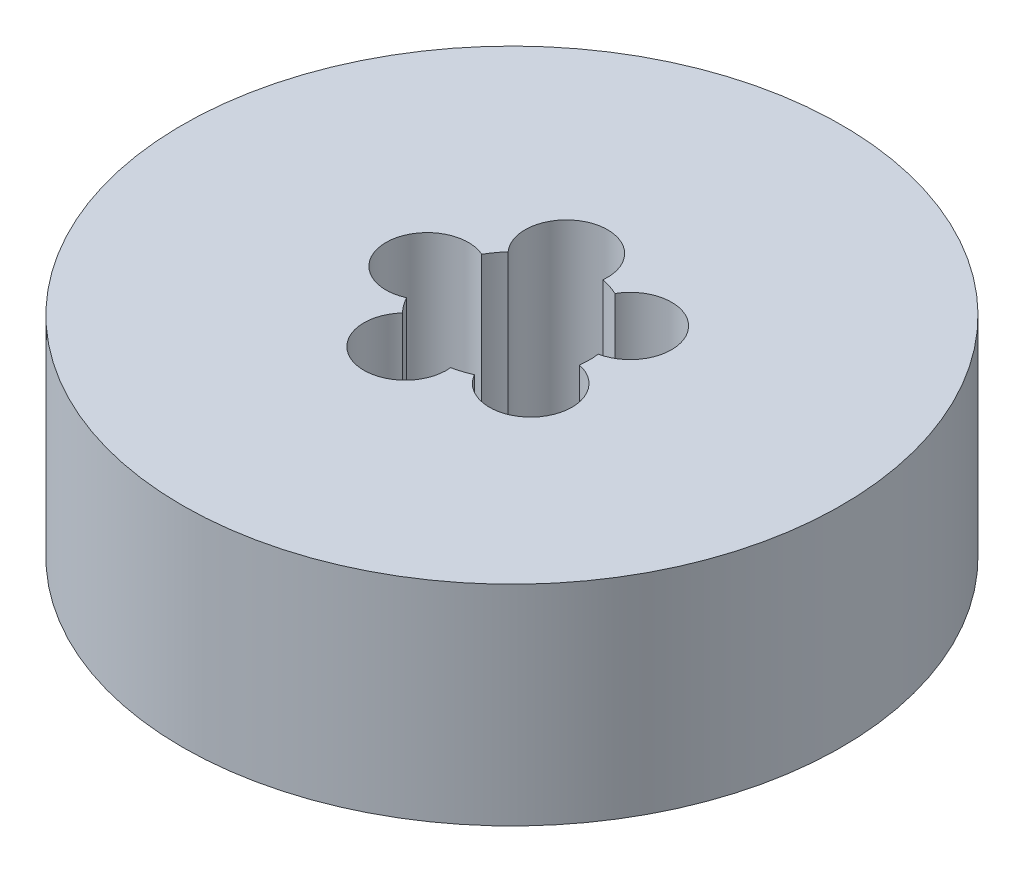
ISO-10303-21;
HEADER;
FILE_DESCRIPTION(('STEP AP214'),'2;1');
FILE_NAME('part.step','',(''),(''),'','','');
FILE_SCHEMA(('AUTOMOTIVE_DESIGN { 1 0 10303 214 1 1 1 1 }'));
ENDSEC;
DATA;
#1=APPLICATION_CONTEXT('core data for automotive mechanical design processes');
#2=APPLICATION_PROTOCOL_DEFINITION('international standard','automotive_design',2000,#1);
#3=PRODUCT_CONTEXT('',#1,'mechanical');
#4=PRODUCT('Part','Part','',(#3));
#5=PRODUCT_RELATED_PRODUCT_CATEGORY('part','',(#4));
#6=PRODUCT_DEFINITION_FORMATION('','',#4);
#7=PRODUCT_DEFINITION_CONTEXT('part definition',#1,'design');
#8=PRODUCT_DEFINITION('design','',#6,#7);
#9=PRODUCT_DEFINITION_SHAPE('','',#8);
#10=(LENGTH_UNIT() NAMED_UNIT(*) SI_UNIT(.MILLI.,.METRE.));
#11=(NAMED_UNIT(*) PLANE_ANGLE_UNIT() SI_UNIT($,.RADIAN.));
#12=(NAMED_UNIT(*) SI_UNIT($,.STERADIAN.) SOLID_ANGLE_UNIT());
#13=UNCERTAINTY_MEASURE_WITH_UNIT(LENGTH_MEASURE(1.E-05),#10,'distance_accuracy_value','');
#14=(GEOMETRIC_REPRESENTATION_CONTEXT(3) GLOBAL_UNCERTAINTY_ASSIGNED_CONTEXT((#13)) GLOBAL_UNIT_ASSIGNED_CONTEXT((#10,
#11,#12)) REPRESENTATION_CONTEXT('',''));
#15=CARTESIAN_POINT('',(0.,0.,0.));
#16=DIRECTION('',(0.,0.,1.));
#17=DIRECTION('',(1.,0.,0.));
#18=AXIS2_PLACEMENT_3D('',#15,#16,#17);
#19=CARTESIAN_POINT('',(0.,27.,0.));
#20=DIRECTION('',(0.,-1.,0.));
#21=DIRECTION('',(0.,0.,-1.));
#22=AXIS2_PLACEMENT_3D('',#19,#20,#21);
#23=CYLINDRICAL_SURFACE('',#22,42.5);
#24=CARTESIAN_POINT('',(0.,27.,0.));
#25=DIRECTION('',(0.,1.,0.));
#26=DIRECTION('',(0.,0.,1.));
#27=AXIS2_PLACEMENT_3D('',#24,#25,#26);
#28=CIRCLE('',#27,42.5);
#29=CARTESIAN_POINT('',(0.,27.,42.5));
#30=VERTEX_POINT('',#29);
#31=EDGE_CURVE('E157',#30,#30,#28,.T.);
#32=ORIENTED_EDGE('',*,*,#31,.F.);
#33=EDGE_LOOP('',(#32));
#34=FACE_BOUND('',#33,.T.);
#35=CARTESIAN_POINT('',(0.,0.,0.));
#36=DIRECTION('',(0.,1.,0.));
#37=DIRECTION('',(0.,0.,1.));
#38=AXIS2_PLACEMENT_3D('',#35,#36,#37);
#39=CIRCLE('',#38,42.5);
#40=CARTESIAN_POINT('',(0.,0.,42.5));
#41=VERTEX_POINT('',#40);
#42=EDGE_CURVE('E150',#41,#41,#39,.T.);
#43=ORIENTED_EDGE('',*,*,#42,.T.);
#44=EDGE_LOOP('',(#43));
#45=FACE_BOUND('',#44,.T.);
#46=ADVANCED_FACE('F39',(#34,#45),#23,.T.);
#47=CARTESIAN_POINT('',(0.,27.,0.));
#48=DIRECTION('',(0.,1.,0.));
#49=DIRECTION('',(0.,0.,1.));
#50=AXIS2_PLACEMENT_3D('',#47,#48,#49);
#51=PLANE('',#50);
#52=CARTESIAN_POINT('',(-3.37625005022032,27.,-10.3910291969498));
#53=DIRECTION('',(0.,1.,0.));
#54=DIRECTION('',(-0.95105651629515,0.,0.309016994374958));
#55=AXIS2_PLACEMENT_3D('',#52,#53,#54);
#56=CIRCLE('',#55,5.31953198471748);
#57=CARTESIAN_POINT('',(1.91205654561294,27.,-9.81549997536441));
#58=VERTEX_POINT('',#57);
#59=CARTESIAN_POINT('',(-7.31629236900321,27.,-6.81702764929594));
#60=VERTEX_POINT('',#59);
#61=EDGE_CURVE('E194',#58,#60,#56,.T.);
#62=ORIENTED_EDGE('',*,*,#61,.F.);
#63=CARTESIAN_POINT('',(0.,27.,0.));
#64=DIRECTION('',(0.,1.,0.));
#65=DIRECTION('',(0.,0.,1.));
#66=AXIS2_PLACEMENT_3D('',#63,#64,#65);
#67=CIRCLE('',#66,10.);
#68=CARTESIAN_POINT('',(4.22251988978942,27.,-9.06478492741735));
#69=VERTEX_POINT('',#68);
#70=EDGE_CURVE('E147',#69,#58,#67,.T.);
#71=ORIENTED_EDGE('',*,*,#70,.F.);
#72=CARTESIAN_POINT('',(8.83913738599498,27.,-6.42200922180761));
#73=DIRECTION('',(0.,1.,0.));
#74=DIRECTION('',(-0.58778525229248,0.,-0.809016994374942));
#75=AXIS2_PLACEMENT_3D('',#72,#73,#74);
#76=CIRCLE('',#75,5.31953198471748);
#77=CARTESIAN_POINT('',(9.9259531790655,27.,-1.21468246344447));
#78=VERTEX_POINT('',#77);
#79=EDGE_CURVE('E254',#78,#69,#76,.T.);
#80=ORIENTED_EDGE('',*,*,#79,.F.);
#81=CARTESIAN_POINT('',(9.92595317906552,27.,1.21468246344432));
#82=VERTEX_POINT('',#81);
#83=EDGE_CURVE('E144',#82,#78,#67,.T.);
#84=ORIENTED_EDGE('',*,*,#83,.F.);
#85=CARTESIAN_POINT('',(8.83913738599507,27.,6.42200922180748));
#86=DIRECTION('',(0.,1.,0.));
#87=DIRECTION('',(0.587785252292469,0.,-0.809016994374951));
#88=AXIS2_PLACEMENT_3D('',#85,#86,#87);
#89=CIRCLE('',#88,5.31953198471748);
#90=CARTESIAN_POINT('',(4.22251988978956,27.,9.06478492741729));
#91=VERTEX_POINT('',#90);
#92=EDGE_CURVE('E141',#91,#82,#89,.T.);
#93=ORIENTED_EDGE('',*,*,#92,.F.);
#94=CARTESIAN_POINT('',(1.91205654561308,27.,9.81549997536438));
#95=VERTEX_POINT('',#94);
#96=EDGE_CURVE('E134',#95,#91,#67,.T.);
#97=ORIENTED_EDGE('',*,*,#96,.F.);
#98=CARTESIAN_POINT('',(-3.37625005022018,27.,10.3910291969499));
#99=DIRECTION('',(0.,1.,0.));
#100=DIRECTION('',(0.951056516295155,0.,0.309016994374945));
#101=AXIS2_PLACEMENT_3D('',#98,#99,#100);
#102=CIRCLE('',#101,5.31953198471748);
#103=CARTESIAN_POINT('',(-7.31629236900312,27.,6.81702764929605));
#104=VERTEX_POINT('',#103);
#105=EDGE_CURVE('E111',#104,#95,#102,.T.);
#106=ORIENTED_EDGE('',*,*,#105,.F.);
#107=CARTESIAN_POINT('',(-8.74423724546493,27.,4.85163013790457));
#108=VERTEX_POINT('',#107);
#109=EDGE_CURVE('E145',#108,#104,#67,.T.);
#110=ORIENTED_EDGE('',*,*,#109,.F.);
#111=CARTESIAN_POINT('',(-10.9257746715497,27.,0.));
#112=DIRECTION('',(0.,1.,0.));
#113=DIRECTION('',(0.,0.,1.));
#114=AXIS2_PLACEMENT_3D('',#111,#112,#113);
#115=CIRCLE('',#114,5.31953198471748);
#116=CARTESIAN_POINT('',(-8.74423724546493,27.,-4.85163013790457));
#117=VERTEX_POINT('',#116);
#118=EDGE_CURVE('E153',#117,#108,#115,.T.);
#119=ORIENTED_EDGE('',*,*,#118,.F.);
#120=EDGE_CURVE('E146',#60,#117,#67,.T.);
#121=ORIENTED_EDGE('',*,*,#120,.F.);
#122=EDGE_LOOP('',(#62,#71,#80,#84,#93,#97,#106,#110,#119,#121));
#123=FACE_BOUND('',#122,.T.);
#124=ORIENTED_EDGE('',*,*,#31,.T.);
#125=EDGE_LOOP('',(#124));
#126=FACE_BOUND('',#125,.T.);
#127=ADVANCED_FACE('F139',(#123,#126),#51,.T.);
#128=CARTESIAN_POINT('',(0.,0.,0.));
#129=DIRECTION('',(0.,1.,0.));
#130=DIRECTION('',(0.,0.,1.));
#131=AXIS2_PLACEMENT_3D('',#128,#129,#130);
#132=PLANE('',#131);
#133=CARTESIAN_POINT('',(0.,0.,0.));
#134=DIRECTION('',(0.,1.,0.));
#135=DIRECTION('',(0.,0.,1.));
#136=AXIS2_PLACEMENT_3D('',#133,#134,#135);
#137=CIRCLE('',#136,10.);
#138=CARTESIAN_POINT('',(0.,0.,10.));
#139=VERTEX_POINT('',#138);
#140=EDGE_CURVE('E154',#139,#139,#137,.T.);
#141=ORIENTED_EDGE('',*,*,#140,.T.);
#142=EDGE_LOOP('',(#141));
#143=FACE_BOUND('',#142,.T.);
#144=ORIENTED_EDGE('',*,*,#42,.F.);
#145=EDGE_LOOP('',(#144));
#146=FACE_BOUND('',#145,.T.);
#147=ADVANCED_FACE('F213',(#143,#146),#132,.F.);
#148=CARTESIAN_POINT('',(0.,27.,0.));
#149=DIRECTION('',(0.,-1.,0.));
#150=DIRECTION('',(0.,0.,-1.));
#151=AXIS2_PLACEMENT_3D('',#148,#149,#150);
#152=CYLINDRICAL_SURFACE('',#151,10.);
#153=DIRECTION('',(0.,1.,0.));
#154=VECTOR('',#153,1.);
#155=CARTESIAN_POINT('',(1.91205654561294,14.9213630930182,-9.81549997536441));
#156=LINE('',#155,#154);
#157=CARTESIAN_POINT('',(1.91205654561294,2.84272618603638,-9.81549997536441));
#158=VERTEX_POINT('',#157);
#159=EDGE_CURVE('E11',#158,#58,#156,.T.);
#160=ORIENTED_EDGE('',*,*,#159,.F.);
#161=CARTESIAN_POINT('',(0.,2.84272618603638,0.));
#162=DIRECTION('',(0.,1.,0.));
#163=DIRECTION('',(0.,0.,1.));
#164=AXIS2_PLACEMENT_3D('',#161,#162,#163);
#165=CIRCLE('',#164,10.);
#166=CARTESIAN_POINT('',(-7.31629236900321,2.84272618603638,-6.81702764929594));
#167=VERTEX_POINT('',#166);
#168=EDGE_CURVE('E189',#158,#167,#165,.T.);
#169=ORIENTED_EDGE('',*,*,#168,.T.);
#170=DIRECTION('',(0.,1.,0.));
#171=VECTOR('',#170,1.);
#172=CARTESIAN_POINT('',(-7.31629236900321,14.9213630930182,-6.81702764929594));
#173=LINE('',#172,#171);
#174=EDGE_CURVE('E46',#60,#167,#173,.F.);
#175=ORIENTED_EDGE('',*,*,#174,.F.);
#176=ORIENTED_EDGE('',*,*,#120,.T.);
#177=DIRECTION('',(0.,1.,0.));
#178=VECTOR('',#177,1.);
#179=CARTESIAN_POINT('',(-8.74423724546493,14.9213630930182,-4.85163013790457));
#180=LINE('',#179,#178);
#181=CARTESIAN_POINT('',(-8.74423724546493,2.84272618603638,-4.85163013790457));
#182=VERTEX_POINT('',#181);
#183=EDGE_CURVE('E168',#182,#117,#180,.T.);
#184=ORIENTED_EDGE('',*,*,#183,.F.);
#185=CARTESIAN_POINT('',(0.,2.84272618603638,0.));
#186=DIRECTION('',(0.,1.,0.));
#187=DIRECTION('',(0.,0.,1.));
#188=AXIS2_PLACEMENT_3D('',#185,#186,#187);
#189=CIRCLE('',#188,10.);
#190=CARTESIAN_POINT('',(-8.74423724546493,2.84272618603638,4.85163013790457));
#191=VERTEX_POINT('',#190);
#192=EDGE_CURVE('E165',#182,#191,#189,.T.);
#193=ORIENTED_EDGE('',*,*,#192,.T.);
#194=DIRECTION('',(0.,1.,0.));
#195=VECTOR('',#194,1.);
#196=CARTESIAN_POINT('',(-8.74423724546493,14.9213630930182,4.85163013790457));
#197=LINE('',#196,#195);
#198=EDGE_CURVE('E170',#108,#191,#197,.F.);
#199=ORIENTED_EDGE('',*,*,#198,.F.);
#200=ORIENTED_EDGE('',*,*,#109,.T.);
#201=DIRECTION('',(0.,1.,0.));
#202=VECTOR('',#201,1.);
#203=CARTESIAN_POINT('',(-7.31629236900311,14.9213630930182,6.81702764929605));
#204=LINE('',#203,#202);
#205=CARTESIAN_POINT('',(-7.31629236900312,2.84272618603638,6.81702764929605));
#206=VERTEX_POINT('',#205);
#207=EDGE_CURVE('E121',#206,#104,#204,.T.);
#208=ORIENTED_EDGE('',*,*,#207,.F.);
#209=CARTESIAN_POINT('',(0.,2.84272618603638,0.));
#210=DIRECTION('',(0.,1.,0.));
#211=DIRECTION('',(0.,0.,1.));
#212=AXIS2_PLACEMENT_3D('',#209,#210,#211);
#213=CIRCLE('',#212,10.);
#214=CARTESIAN_POINT('',(1.91205654561308,2.84272618603638,9.81549997536438));
#215=VERTEX_POINT('',#214);
#216=EDGE_CURVE('E136',#206,#215,#213,.T.);
#217=ORIENTED_EDGE('',*,*,#216,.T.);
#218=DIRECTION('',(0.,1.,0.));
#219=VECTOR('',#218,1.);
#220=CARTESIAN_POINT('',(1.91205654561308,14.9213630930182,9.81549997536438));
#221=LINE('',#220,#219);
#222=EDGE_CURVE('E117',#95,#215,#221,.F.);
#223=ORIENTED_EDGE('',*,*,#222,.F.);
#224=ORIENTED_EDGE('',*,*,#96,.T.);
#225=DIRECTION('',(0.,1.,0.));
#226=VECTOR('',#225,1.);
#227=CARTESIAN_POINT('',(4.22251988978956,14.9213630930182,9.06478492741729));
#228=LINE('',#227,#226);
#229=CARTESIAN_POINT('',(4.22251988978956,2.84272618603638,9.06478492741729));
#230=VERTEX_POINT('',#229);
#231=EDGE_CURVE('E182',#230,#91,#228,.T.);
#232=ORIENTED_EDGE('',*,*,#231,.F.);
#233=CARTESIAN_POINT('',(0.,2.84272618603638,0.));
#234=DIRECTION('',(0.,1.,0.));
#235=DIRECTION('',(0.,0.,1.));
#236=AXIS2_PLACEMENT_3D('',#233,#234,#235);
#237=CIRCLE('',#236,10.);
#238=CARTESIAN_POINT('',(9.92595317906552,2.84272618603638,1.21468246344432));
#239=VERTEX_POINT('',#238);
#240=EDGE_CURVE('E174',#230,#239,#237,.T.);
#241=ORIENTED_EDGE('',*,*,#240,.T.);
#242=DIRECTION('',(0.,1.,0.));
#243=VECTOR('',#242,1.);
#244=CARTESIAN_POINT('',(9.92595317906552,14.9213630930182,1.21468246344432));
#245=LINE('',#244,#243);
#246=EDGE_CURVE('E177',#82,#239,#245,.F.);
#247=ORIENTED_EDGE('',*,*,#246,.F.);
#248=ORIENTED_EDGE('',*,*,#83,.T.);
#249=DIRECTION('',(0.,1.,0.));
#250=VECTOR('',#249,1.);
#251=CARTESIAN_POINT('',(9.9259531790655,14.9213630930182,-1.21468246344447));
#252=LINE('',#251,#250);
#253=CARTESIAN_POINT('',(9.9259531790655,2.84272618603638,-1.21468246344447));
#254=VERTEX_POINT('',#253);
#255=EDGE_CURVE('E187',#254,#78,#252,.T.);
#256=ORIENTED_EDGE('',*,*,#255,.F.);
#257=CARTESIAN_POINT('',(0.,2.84272618603638,0.));
#258=DIRECTION('',(0.,1.,0.));
#259=DIRECTION('',(0.,0.,1.));
#260=AXIS2_PLACEMENT_3D('',#257,#258,#259);
#261=CIRCLE('',#260,10.);
#262=CARTESIAN_POINT('',(4.22251988978942,2.84272618603638,-9.06478492741735));
#263=VERTEX_POINT('',#262);
#264=EDGE_CURVE('E181',#254,#263,#261,.T.);
#265=ORIENTED_EDGE('',*,*,#264,.T.);
#266=DIRECTION('',(0.,1.,0.));
#267=VECTOR('',#266,1.);
#268=CARTESIAN_POINT('',(4.22251988978942,14.9213630930182,-9.06478492741735));
#269=LINE('',#268,#267);
#270=EDGE_CURVE('E186',#69,#263,#269,.F.);
#271=ORIENTED_EDGE('',*,*,#270,.F.);
#272=ORIENTED_EDGE('',*,*,#70,.T.);
#273=EDGE_LOOP('',(#160,#169,#175,#176,#184,#193,#199,#200,#208,#217,#223,#224,#232,#241,#247,
#248,#256,#265,#271,#272));
#274=FACE_BOUND('',#273,.T.);
#275=ORIENTED_EDGE('',*,*,#140,.F.);
#276=EDGE_LOOP('',(#275));
#277=FACE_BOUND('',#276,.T.);
#278=ADVANCED_FACE('F135',(#274,#277),#152,.F.);
#279=CARTESIAN_POINT('',(-10.9257746715497,2.84272618603638,0.));
#280=DIRECTION('',(0.,1.,0.));
#281=DIRECTION('',(0.,0.,1.));
#282=AXIS2_PLACEMENT_3D('',#279,#280,#281);
#283=CYLINDRICAL_SURFACE('',#282,5.31953198471748);
#284=ORIENTED_EDGE('',*,*,#183,.T.);
#285=ORIENTED_EDGE('',*,*,#118,.T.);
#286=ORIENTED_EDGE('',*,*,#198,.T.);
#287=CARTESIAN_POINT('',(-10.9257746715497,2.84272618603638,0.));
#288=DIRECTION('',(0.,1.,0.));
#289=DIRECTION('',(0.,0.,1.));
#290=AXIS2_PLACEMENT_3D('',#287,#288,#289);
#291=CIRCLE('',#290,5.31953198471748);
#292=EDGE_CURVE('E158',#182,#191,#291,.T.);
#293=ORIENTED_EDGE('',*,*,#292,.F.);
#294=EDGE_LOOP('',(#284,#285,#286,#293));
#295=FACE_BOUND('',#294,.T.);
#296=ADVANCED_FACE('F221',(#295),#283,.F.);
#297=CARTESIAN_POINT('',(-10.9257746715497,2.84272618603638,0.));
#298=DIRECTION('',(0.,1.,0.));
#299=DIRECTION('',(0.,0.,1.));
#300=AXIS2_PLACEMENT_3D('',#297,#298,#299);
#301=PLANE('',#300);
#302=ORIENTED_EDGE('',*,*,#292,.T.);
#303=ORIENTED_EDGE('',*,*,#192,.F.);
#304=EDGE_LOOP('',(#302,#303));
#305=FACE_BOUND('',#304,.T.);
#306=ADVANCED_FACE('F227',(#305),#301,.T.);
#307=CARTESIAN_POINT('',(-3.37625005022018,2.84272618603638,10.3910291969499));
#308=DIRECTION('',(0.,1.,0.));
#309=DIRECTION('',(0.,0.,1.));
#310=AXIS2_PLACEMENT_3D('',#307,#308,#309);
#311=CYLINDRICAL_SURFACE('',#310,5.31953198471748);
#312=ORIENTED_EDGE('',*,*,#207,.T.);
#313=ORIENTED_EDGE('',*,*,#105,.T.);
#314=ORIENTED_EDGE('',*,*,#222,.T.);
#315=CARTESIAN_POINT('',(-3.37625005022018,2.84272618603638,10.3910291969499));
#316=DIRECTION('',(0.,1.,0.));
#317=DIRECTION('',(0.951056516295155,0.,0.309016994374945));
#318=AXIS2_PLACEMENT_3D('',#315,#316,#317);
#319=CIRCLE('',#318,5.31953198471748);
#320=EDGE_CURVE('E127',#206,#215,#319,.T.);
#321=ORIENTED_EDGE('',*,*,#320,.F.);
#322=EDGE_LOOP('',(#312,#313,#314,#321));
#323=FACE_BOUND('',#322,.T.);
#324=ADVANCED_FACE('F116',(#323),#311,.F.);
#325=CARTESIAN_POINT('',(-3.37625005022018,2.84272618603638,10.3910291969499));
#326=DIRECTION('',(0.,1.,0.));
#327=DIRECTION('',(0.951056516295155,0.,0.309016994374945));
#328=AXIS2_PLACEMENT_3D('',#325,#326,#327);
#329=PLANE('',#328);
#330=ORIENTED_EDGE('',*,*,#320,.T.);
#331=ORIENTED_EDGE('',*,*,#216,.F.);
#332=EDGE_LOOP('',(#330,#331));
#333=FACE_BOUND('',#332,.T.);
#334=ADVANCED_FACE('F234',(#333),#329,.T.);
#335=CARTESIAN_POINT('',(8.83913738599507,2.84272618603638,6.42200922180748));
#336=DIRECTION('',(0.,1.,0.));
#337=DIRECTION('',(0.,0.,1.));
#338=AXIS2_PLACEMENT_3D('',#335,#336,#337);
#339=CYLINDRICAL_SURFACE('',#338,5.31953198471748);
#340=ORIENTED_EDGE('',*,*,#231,.T.);
#341=ORIENTED_EDGE('',*,*,#92,.T.);
#342=ORIENTED_EDGE('',*,*,#246,.T.);
#343=CARTESIAN_POINT('',(8.83913738599507,2.84272618603638,6.42200922180748));
#344=DIRECTION('',(0.,1.,0.));
#345=DIRECTION('',(0.587785252292469,0.,-0.809016994374951));
#346=AXIS2_PLACEMENT_3D('',#343,#344,#345);
#347=CIRCLE('',#346,5.31953198471748);
#348=EDGE_CURVE('E130',#230,#239,#347,.T.);
#349=ORIENTED_EDGE('',*,*,#348,.F.);
#350=EDGE_LOOP('',(#340,#341,#342,#349));
#351=FACE_BOUND('',#350,.T.);
#352=ADVANCED_FACE('F240',(#351),#339,.F.);
#353=CARTESIAN_POINT('',(8.83913738599507,2.84272618603638,6.42200922180748));
#354=DIRECTION('',(0.,1.,0.));
#355=DIRECTION('',(0.587785252292469,0.,-0.809016994374951));
#356=AXIS2_PLACEMENT_3D('',#353,#354,#355);
#357=PLANE('',#356);
#358=ORIENTED_EDGE('',*,*,#348,.T.);
#359=ORIENTED_EDGE('',*,*,#240,.F.);
#360=EDGE_LOOP('',(#358,#359));
#361=FACE_BOUND('',#360,.T.);
#362=ADVANCED_FACE('F245',(#361),#357,.T.);
#363=CARTESIAN_POINT('',(8.83913738599498,2.84272618603638,-6.42200922180761));
#364=DIRECTION('',(0.,1.,0.));
#365=DIRECTION('',(0.,0.,1.));
#366=AXIS2_PLACEMENT_3D('',#363,#364,#365);
#367=CYLINDRICAL_SURFACE('',#366,5.31953198471748);
#368=ORIENTED_EDGE('',*,*,#255,.T.);
#369=ORIENTED_EDGE('',*,*,#79,.T.);
#370=ORIENTED_EDGE('',*,*,#270,.T.);
#371=CARTESIAN_POINT('',(8.83913738599498,2.84272618603638,-6.42200922180761));
#372=DIRECTION('',(0.,1.,0.));
#373=DIRECTION('',(-0.58778525229248,0.,-0.809016994374942));
#374=AXIS2_PLACEMENT_3D('',#371,#372,#373);
#375=CIRCLE('',#374,5.31953198471748);
#376=EDGE_CURVE('E56',#254,#263,#375,.T.);
#377=ORIENTED_EDGE('',*,*,#376,.F.);
#378=EDGE_LOOP('',(#368,#369,#370,#377));
#379=FACE_BOUND('',#378,.T.);
#380=ADVANCED_FACE('F266',(#379),#367,.F.);
#381=CARTESIAN_POINT('',(8.83913738599498,2.84272618603638,-6.42200922180761));
#382=DIRECTION('',(0.,1.,0.));
#383=DIRECTION('',(-0.58778525229248,0.,-0.809016994374942));
#384=AXIS2_PLACEMENT_3D('',#381,#382,#383);
#385=PLANE('',#384);
#386=ORIENTED_EDGE('',*,*,#376,.T.);
#387=ORIENTED_EDGE('',*,*,#264,.F.);
#388=EDGE_LOOP('',(#386,#387));
#389=FACE_BOUND('',#388,.T.);
#390=ADVANCED_FACE('F204',(#389),#385,.T.);
#391=CARTESIAN_POINT('',(-3.37625005022032,2.84272618603638,-10.3910291969498));
#392=DIRECTION('',(0.,1.,0.));
#393=DIRECTION('',(0.,0.,1.));
#394=AXIS2_PLACEMENT_3D('',#391,#392,#393);
#395=CYLINDRICAL_SURFACE('',#394,5.31953198471748);
#396=ORIENTED_EDGE('',*,*,#159,.T.);
#397=ORIENTED_EDGE('',*,*,#61,.T.);
#398=ORIENTED_EDGE('',*,*,#174,.T.);
#399=CARTESIAN_POINT('',(-3.37625005022032,2.84272618603638,-10.3910291969498));
#400=DIRECTION('',(0.,1.,0.));
#401=DIRECTION('',(-0.95105651629515,0.,0.309016994374958));
#402=AXIS2_PLACEMENT_3D('',#399,#400,#401);
#403=CIRCLE('',#402,5.31953198471748);
#404=EDGE_CURVE('E55',#158,#167,#403,.T.);
#405=ORIENTED_EDGE('',*,*,#404,.F.);
#406=EDGE_LOOP('',(#396,#397,#398,#405));
#407=FACE_BOUND('',#406,.T.);
#408=ADVANCED_FACE('F193',(#407),#395,.F.);
#409=CARTESIAN_POINT('',(-3.37625005022032,2.84272618603638,-10.3910291969498));
#410=DIRECTION('',(0.,1.,0.));
#411=DIRECTION('',(-0.95105651629515,0.,0.309016994374958));
#412=AXIS2_PLACEMENT_3D('',#409,#410,#411);
#413=PLANE('',#412);
#414=ORIENTED_EDGE('',*,*,#404,.T.);
#415=ORIENTED_EDGE('',*,*,#168,.F.);
#416=EDGE_LOOP('',(#414,#415));
#417=FACE_BOUND('',#416,.T.);
#418=ADVANCED_FACE('F196',(#417),#413,.T.);
#419=CLOSED_SHELL('',(#46,#127,#147,#278,#296,#306,#324,#334,#352,#362,#380,#390,#408,#418));
#420=MANIFOLD_SOLID_BREP('B2',#419);
#421=ADVANCED_BREP_SHAPE_REPRESENTATION('',(#18,#420),#14);
#422=SHAPE_DEFINITION_REPRESENTATION(#9,#421);
ENDSEC;
END-ISO-10303-21;
